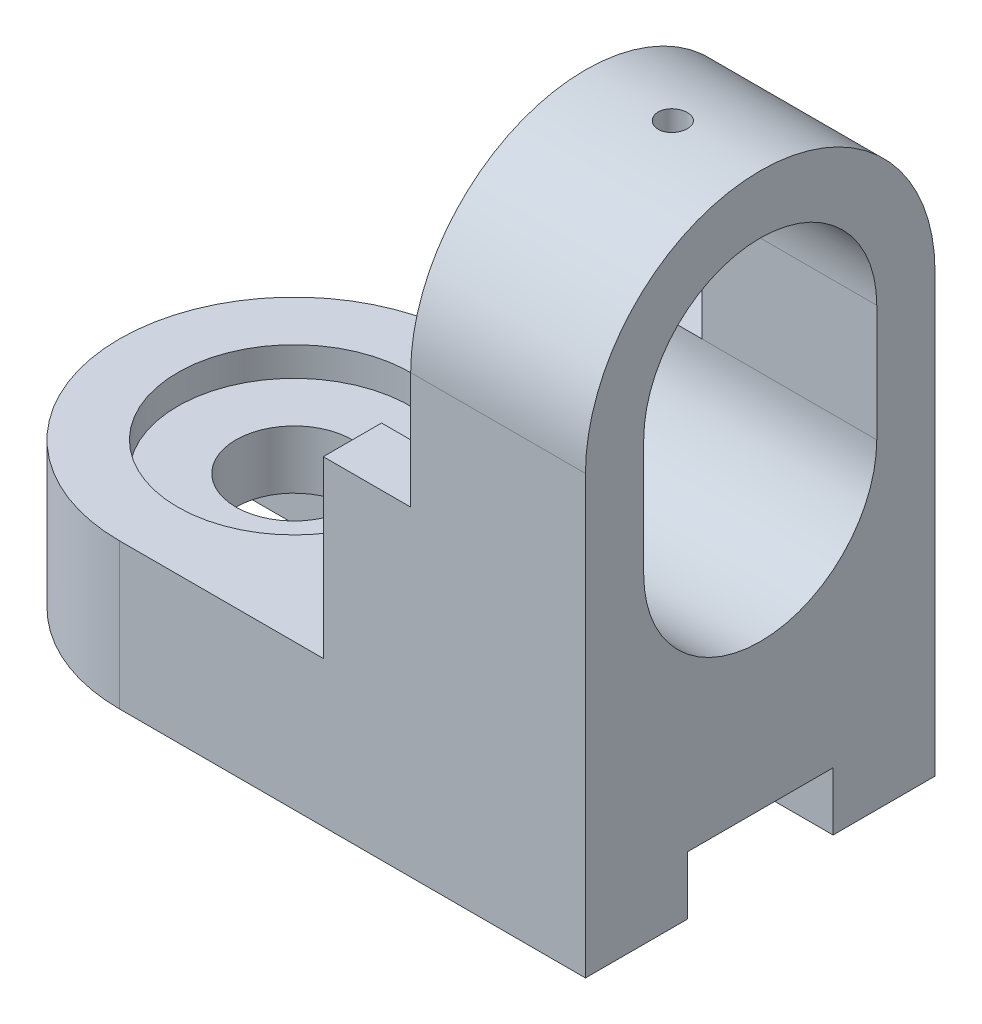
ISO-10303-21;
HEADER;
FILE_DESCRIPTION(('STEP AP214'),'2;1');
FILE_NAME('part.step','',(''),(''),'','','');
FILE_SCHEMA(('AUTOMOTIVE_DESIGN { 1 0 10303 214 1 1 1 1 }'));
ENDSEC;
DATA;
#1=APPLICATION_CONTEXT('core data for automotive mechanical design processes');
#2=APPLICATION_PROTOCOL_DEFINITION('international standard','automotive_design',2000,#1);
#3=PRODUCT_CONTEXT('',#1,'mechanical');
#4=PRODUCT('Part','Part','',(#3));
#5=PRODUCT_RELATED_PRODUCT_CATEGORY('part','',(#4));
#6=PRODUCT_DEFINITION_FORMATION('','',#4);
#7=PRODUCT_DEFINITION_CONTEXT('part definition',#1,'design');
#8=PRODUCT_DEFINITION('design','',#6,#7);
#9=PRODUCT_DEFINITION_SHAPE('','',#8);
#10=(LENGTH_UNIT() NAMED_UNIT(*) SI_UNIT(.MILLI.,.METRE.));
#11=(NAMED_UNIT(*) PLANE_ANGLE_UNIT() SI_UNIT($,.RADIAN.));
#12=(NAMED_UNIT(*) SI_UNIT($,.STERADIAN.) SOLID_ANGLE_UNIT());
#13=UNCERTAINTY_MEASURE_WITH_UNIT(LENGTH_MEASURE(1.E-05),#10,'distance_accuracy_value','');
#14=(GEOMETRIC_REPRESENTATION_CONTEXT(3) GLOBAL_UNCERTAINTY_ASSIGNED_CONTEXT((#13)) GLOBAL_UNIT_ASSIGNED_CONTEXT((#10,
#11,#12)) REPRESENTATION_CONTEXT('',''));
#15=CARTESIAN_POINT('',(0.,0.,0.));
#16=DIRECTION('',(0.,0.,1.));
#17=DIRECTION('',(1.,0.,0.));
#18=AXIS2_PLACEMENT_3D('',#15,#16,#17);
#19=CARTESIAN_POINT('',(35.,75.,0.));
#20=DIRECTION('',(1.,0.,0.));
#21=DIRECTION('',(0.,0.,-1.));
#22=AXIS2_PLACEMENT_3D('',#19,#20,#21);
#23=CYLINDRICAL_SURFACE('',#22,20.);
#24=DIRECTION('',(1.,0.,0.));
#25=VECTOR('',#24,1.);
#26=CARTESIAN_POINT('',(35.,75.,20.));
#27=LINE('',#26,#25);
#28=CARTESIAN_POINT('',(50.,75.,20.));
#29=VERTEX_POINT('',#28);
#30=CARTESIAN_POINT('',(80.,75.,20.));
#31=VERTEX_POINT('',#30);
#32=EDGE_CURVE('E246',#29,#31,#27,.T.);
#33=ORIENTED_EDGE('',*,*,#32,.F.);
#34=CARTESIAN_POINT('',(50.,75.,0.));
#35=DIRECTION('',(1.,0.,0.));
#36=DIRECTION('',(0.,0.,-1.));
#37=AXIS2_PLACEMENT_3D('',#34,#35,#36);
#38=CIRCLE('',#37,20.);
#39=CARTESIAN_POINT('',(50.,75.,-20.));
#40=VERTEX_POINT('',#39);
#41=EDGE_CURVE('E333',#29,#40,#38,.F.);
#42=ORIENTED_EDGE('',*,*,#41,.T.);
#43=DIRECTION('',(1.,0.,0.));
#44=VECTOR('',#43,1.);
#45=CARTESIAN_POINT('',(35.,75.,-20.));
#46=LINE('',#45,#44);
#47=CARTESIAN_POINT('',(80.,75.,-20.));
#48=VERTEX_POINT('',#47);
#49=EDGE_CURVE('E244',#40,#48,#46,.T.);
#50=ORIENTED_EDGE('',*,*,#49,.T.);
#51=CARTESIAN_POINT('',(80.,75.,0.));
#52=DIRECTION('',(1.,0.,0.));
#53=DIRECTION('',(0.,0.,-1.));
#54=AXIS2_PLACEMENT_3D('',#51,#52,#53);
#55=CIRCLE('',#54,20.);
#56=EDGE_CURVE('E235',#48,#31,#55,.T.);
#57=ORIENTED_EDGE('',*,*,#56,.T.);
#58=EDGE_LOOP('',(#33,#42,#50,#57));
#59=FACE_BOUND('',#58,.T.);
#60=CARTESIAN_POINT('',(65.,94.8431348329844,-2.5));
#61=CARTESIAN_POINT('',(65.1398362838005,94.8431368414673,-2.49999405483337));
#62=CARTESIAN_POINT('',(65.2797599649306,94.8446289499888,-2.48822789901659));
#63=CARTESIAN_POINT('',(65.5557132254284,94.8504339085542,-2.44147641371666));
#64=CARTESIAN_POINT('',(65.6917385805018,94.8547497060959,-2.4064668210908));
#65=CARTESIAN_POINT('',(65.9558598821076,94.8657057380876,-2.31427669282773));
#66=CARTESIAN_POINT('',(66.0839611421164,94.8723443946258,-2.25711120479872));
#67=CARTESIAN_POINT('',(66.3287284518253,94.8871962351098,-2.12226419842906));
#68=CARTESIAN_POINT('',(66.4453964517436,94.8954091498188,-2.04458618737467));
#69=CARTESIAN_POINT('',(66.6646622471215,94.9125355924631,-1.87045345026456));
#70=CARTESIAN_POINT('',(66.7671868023187,94.9214524170269,-1.77390681502434));
#71=CARTESIAN_POINT('',(66.9546227689392,94.9389523287518,-1.5649752606712));
#72=CARTESIAN_POINT('',(67.0395333040947,94.9475353992921,-1.45258955405803));
#73=CARTESIAN_POINT('',(67.1895935795063,94.96343444613,-1.21470983067598));
#74=CARTESIAN_POINT('',(67.2546770450996,94.9707461384685,-1.08917369556112));
#75=CARTESIAN_POINT('',(67.362811199941,94.9832423695448,-0.828846718055924));
#76=CARTESIAN_POINT('',(67.4058627069265,94.9884269872295,-0.694056219360914));
#77=CARTESIAN_POINT('',(67.4684920683344,94.9960616870624,-0.419795687751122));
#78=CARTESIAN_POINT('',(67.4881916785239,94.9985259483594,-0.280353859663387));
#79=CARTESIAN_POINT('',(67.5039353850365,95.0004906972921,-0.000123200686556063));
#80=CARTESIAN_POINT('',(67.4999804119525,94.9999913015208,0.140665576994761));
#81=CARTESIAN_POINT('',(67.4686247972426,94.9960964777001,0.418765268974537));
#82=CARTESIAN_POINT('',(67.4413551015186,94.9927172245573,0.556091205764442));
#83=CARTESIAN_POINT('',(67.3643488233701,94.9834605594233,0.824202163905364));
#84=CARTESIAN_POINT('',(67.3146118138332,94.9775830999404,0.954987060856193));
#85=CARTESIAN_POINT('',(67.1939435072162,94.9639625780791,1.20670881543863));
#86=CARTESIAN_POINT('',(67.1229555422698,94.9562145384324,1.32761822784051));
#87=CARTESIAN_POINT('',(66.961841637784,94.9397196906528,1.55585745230647));
#88=CARTESIAN_POINT('',(66.8717148205314,94.9309728367226,1.66318664121735));
#89=CARTESIAN_POINT('',(66.6741481814016,94.9133886752351,1.86198803077293));
#90=CARTESIAN_POINT('',(66.5665942404533,94.9045511580473,1.95334683999598));
#91=CARTESIAN_POINT('',(66.3376184432176,94.8878407194058,2.11673285062509));
#92=CARTESIAN_POINT('',(66.216196543462,94.8799678009758,2.18875999143508));
#93=CARTESIAN_POINT('',(65.9628305044377,94.8660780261272,2.31144457358272));
#94=CARTESIAN_POINT('',(65.8308819200468,94.8600619590813,2.36209292986232));
#95=CARTESIAN_POINT('',(65.5602605464732,94.8505824249595,2.44048165446808));
#96=CARTESIAN_POINT('',(65.4215880816913,94.847118834867,2.46822312679961));
#97=CARTESIAN_POINT('',(65.1424568180003,94.8431588878405,2.4998604319086));
#98=CARTESIAN_POINT('',(65.0020163769112,94.8426426744237,2.50391584199828));
#99=CARTESIAN_POINT('',(64.7224580703346,94.8445834111965,2.48848695323056));
#100=CARTESIAN_POINT('',(64.5833401767207,94.8470402980145,2.46900315610981));
#101=CARTESIAN_POINT('',(64.3108542364222,94.8546322848399,2.40718328579773));
#102=CARTESIAN_POINT('',(64.1774683848096,94.8597583269466,2.36492448374606));
#103=CARTESIAN_POINT('',(63.9196758451468,94.872103699708,2.25883371911613));
#104=CARTESIAN_POINT('',(63.7952694727591,94.8793231039076,2.19500099858122));
#105=CARTESIAN_POINT('',(63.558245356187,94.8950893135323,2.04718202215492));
#106=CARTESIAN_POINT('',(63.4456933346856,94.9036429273708,1.9630911195771));
#107=CARTESIAN_POINT('',(63.236243446065,94.9210923955102,1.77729074236895));
#108=CARTESIAN_POINT('',(63.139346188132,94.9299882631129,1.67558058242548));
#109=CARTESIAN_POINT('',(62.9633958126656,94.9471808868696,1.45673177555852));
#110=CARTESIAN_POINT('',(62.884447553205,94.9554739391252,1.33950849211704));
#111=CARTESIAN_POINT('',(62.7473617823662,94.9704711303161,1.09337258168179));
#112=CARTESIAN_POINT('',(62.689223851519,94.9771753012772,0.964460190368327));
#113=CARTESIAN_POINT('',(62.595582213092,94.9882229065318,0.698953859139462));
#114=CARTESIAN_POINT('',(62.5600179039684,94.992572656877,0.562381566511787));
#115=CARTESIAN_POINT('',(62.5123359107733,94.9984475467757,0.285146057277968));
#116=CARTESIAN_POINT('',(62.5002171694008,94.9999728137019,0.144483025438114));
#117=CARTESIAN_POINT('',(62.4997900777079,95.0000262801365,-0.135917183343772));
#118=CARTESIAN_POINT('',(62.511320039432,94.998574831678,-0.275654137714715));
#119=CARTESIAN_POINT('',(62.5575206134309,94.9928784115798,-0.55118774145261));
#120=CARTESIAN_POINT('',(62.5921912096118,94.9886334418829,-0.686984393559869));
#121=CARTESIAN_POINT('',(62.6836381143496,94.9778248521189,-0.950761442987277));
#122=CARTESIAN_POINT('',(62.740406679373,94.9712620443393,-1.07874456015945));
#123=CARTESIAN_POINT('',(62.8744213146078,94.9565444760682,-1.32339333714412));
#124=CARTESIAN_POINT('',(62.9516676282626,94.9483896966512,-1.44005886238843));
#125=CARTESIAN_POINT('',(63.1250432153355,94.9313319392356,-1.65958676796214));
#126=CARTESIAN_POINT('',(63.2212927935204,94.9224244127137,-1.76235378783276));
#127=CARTESIAN_POINT('',(63.4296929440321,94.9049015902109,-1.95034111882086));
#128=CARTESIAN_POINT('',(63.5418472775031,94.8962863639518,-2.03555726779919));
#129=CARTESIAN_POINT('',(63.779369922687,94.8802881136638,-2.18630524251151));
#130=CARTESIAN_POINT('',(63.9047875898932,94.8729099764648,-2.2517597831474));
#131=CARTESIAN_POINT('',(64.1648567405525,94.8602785801802,-2.36058528832413));
#132=CARTESIAN_POINT('',(64.2994979992923,94.8550230113382,-2.40398027122393));
#133=CARTESIAN_POINT('',(64.5290299870492,94.8485078683333,-2.4570658962405));
#134=CARTESIAN_POINT('',(64.6224729515397,94.8465030152111,-2.47314303101111));
#135=CARTESIAN_POINT('',(64.8105972499648,94.843815822307,-2.49461205590497));
#136=CARTESIAN_POINT('',(64.9052785744979,94.8431334724908,-2.5000040270997));
#137=CARTESIAN_POINT('',(65.,94.8431348329844,-2.5));
#138=B_SPLINE_CURVE_WITH_KNOTS('',3,(#60,#61,#62,#63,#64,#65,#66,#67,#68,#69,#70,#71,#72,#73,
#74,#75,#76,#77,#78,#79,#80,#81,#82,#83,#84,#85,#86,#87,#88,#89,#90,#91,#92,#93,#94,#95,#96,#97,
#98,#99,#100,#101,#102,#103,#104,#105,#106,#107,#108,#109,#110,#111,#112,#113,#114,#115,#116,
#117,#118,#119,#120,#121,#122,#123,#124,#125,#126,#127,#128,#129,#130,#131,#132,#133,#134,#135,
#136,#137),.UNSPECIFIED.,.T.,.F.,(4,2,2,2,2,2,2,2,2,2,2,2,2,2,2,2,2,2,2,2,2,2,2,2,2,2,2,2,2,2,2,
2,2,2,2,2,2,2,4),(0.,0.419162817491652,0.838763876176496,1.2580804526053,1.67732537953023,
2.09866577551476,2.5200271274499,2.94278186148152,3.36552090342241,3.78604596943868,
4.20655449172519,4.62471664935449,5.042886756742,5.46218204415215,5.88149656471515,
6.30367697380179,6.72585870621835,7.14821966741417,7.57056027158599,7.99005217808293,
8.40953514329525,8.82760376295143,9.24568707214264,9.66597819546522,10.0862856699722,
10.5089888589475,10.9316835271129,11.3532385678735,11.7747745977522,12.1934381629066,
12.612101436892,13.030618135465,13.4491398096666,13.8704012889325,14.2917625544224,
14.7147509770793,15.1372778598593,15.4212098963686,15.7051397785939),.UNSPECIFIED.);
#139=CARTESIAN_POINT('',(65.,94.8431348329844,-2.5));
#140=VERTEX_POINT('',#139);
#141=EDGE_CURVE('E309',#140,#140,#138,.T.);
#142=ORIENTED_EDGE('',*,*,#141,.F.);
#143=EDGE_LOOP('',(#142));
#144=FACE_BOUND('',#143,.T.);
#145=ADVANCED_FACE('F35',(#59,#144),#23,.F.);
#146=CARTESIAN_POINT('',(35.,75.,0.));
#147=DIRECTION('',(1.,0.,0.));
#148=DIRECTION('',(0.,0.,-1.));
#149=AXIS2_PLACEMENT_3D('',#146,#147,#148);
#150=CYLINDRICAL_SURFACE('',#149,30.);
#151=CARTESIAN_POINT('',(50.,75.,0.));
#152=DIRECTION('',(1.,0.,0.));
#153=DIRECTION('',(0.,0.,-1.));
#154=AXIS2_PLACEMENT_3D('',#151,#152,#153);
#155=CIRCLE('',#154,30.);
#156=CARTESIAN_POINT('',(50.,75.,30.));
#157=VERTEX_POINT('',#156);
#158=CARTESIAN_POINT('',(50.,75.,-30.));
#159=VERTEX_POINT('',#158);
#160=EDGE_CURVE('E338',#157,#159,#155,.F.);
#161=ORIENTED_EDGE('',*,*,#160,.F.);
#162=DIRECTION('',(1.,0.,0.));
#163=VECTOR('',#162,1.);
#164=CARTESIAN_POINT('',(35.,75.,30.));
#165=LINE('',#164,#163);
#166=CARTESIAN_POINT('',(80.,75.,30.));
#167=VERTEX_POINT('',#166);
#168=EDGE_CURVE('E224',#157,#167,#165,.T.);
#169=ORIENTED_EDGE('',*,*,#168,.T.);
#170=CARTESIAN_POINT('',(80.,75.,0.));
#171=DIRECTION('',(1.,0.,0.));
#172=DIRECTION('',(0.,0.,-1.));
#173=AXIS2_PLACEMENT_3D('',#170,#171,#172);
#174=CIRCLE('',#173,30.);
#175=CARTESIAN_POINT('',(80.,75.,-30.));
#176=VERTEX_POINT('',#175);
#177=EDGE_CURVE('E225',#176,#167,#174,.T.);
#178=ORIENTED_EDGE('',*,*,#177,.F.);
#179=DIRECTION('',(1.,0.,0.));
#180=VECTOR('',#179,1.);
#181=CARTESIAN_POINT('',(35.,75.,-30.));
#182=LINE('',#181,#180);
#183=EDGE_CURVE('E252',#159,#176,#182,.T.);
#184=ORIENTED_EDGE('',*,*,#183,.F.);
#185=EDGE_LOOP('',(#161,#169,#178,#184));
#186=FACE_BOUND('',#185,.T.);
#187=CARTESIAN_POINT('',(65.,104.895651857753,-2.5));
#188=CARTESIAN_POINT('',(65.140164271976,104.895653240209,-2.49999387707595));
#189=CARTESIAN_POINT('',(65.2804239653942,104.896648199565,-2.48817272989955));
#190=CARTESIAN_POINT('',(65.5570625508586,104.900520493732,-2.44118994768572));
#191=CARTESIAN_POINT('',(65.693436862819,104.903399961378,-2.40600186590413));
#192=CARTESIAN_POINT('',(65.9582579903133,104.9107128874,-2.31330996184381));
#193=CARTESIAN_POINT('',(66.0867092523874,104.91514546464,-2.25581879093882));
#194=CARTESIAN_POINT('',(66.3321079880248,104.92506406754,-2.12017517121364));
#195=CARTESIAN_POINT('',(66.4490579136376,104.930549867918,-2.04202713953173));
#196=CARTESIAN_POINT('',(66.6684650076666,104.941972619487,-1.86707134114509));
#197=CARTESIAN_POINT('',(66.7708885796574,104.947910569226,-1.7702215035047));
#198=CARTESIAN_POINT('',(66.958046915595,104.959559415269,-1.56070030169024));
#199=CARTESIAN_POINT('',(67.0427809067189,104.965270301646,-1.4480282466342));
#200=CARTESIAN_POINT('',(67.1922665366404,104.975831012688,-1.20986061327198));
#201=CARTESIAN_POINT('',(67.2569891079536,104.980679580499,-1.08434673031465));
#202=CARTESIAN_POINT('',(67.3644287277962,104.988958594307,-0.824186001246913));
#203=CARTESIAN_POINT('',(67.4071461614955,104.992389065127,-0.689539315040408));
#204=CARTESIAN_POINT('',(67.4692662096401,104.997438386317,-0.41526948986953));
#205=CARTESIAN_POINT('',(67.4887231777986,104.999061459499,-0.275658740580807));
#206=CARTESIAN_POINT('',(67.5039380079615,105.000327418356,0.0048557047245437));
#207=CARTESIAN_POINT('',(67.4996963106748,104.999970340854,0.145759376648867));
#208=CARTESIAN_POINT('',(67.4676786695516,104.99731971597,0.424491378797032));
#209=CARTESIAN_POINT('',(67.4399611754895,104.995030978063,0.56232647518116));
#210=CARTESIAN_POINT('',(67.3618696225948,104.988779996365,0.831381165100608));
#211=CARTESIAN_POINT('',(67.3114953481936,104.984817736652,0.962600695678749));
#212=CARTESIAN_POINT('',(67.1894550322036,104.975657197807,1.21488540159214));
#213=CARTESIAN_POINT('',(67.1177628135031,104.970457400634,1.33593785664744));
#214=CARTESIAN_POINT('',(66.9551406960534,104.959406131731,1.56431333969343));
#215=CARTESIAN_POINT('',(66.8642104070859,104.953554646784,1.67163608912467));
#216=CARTESIAN_POINT('',(66.6653639001119,104.941836618682,1.86984741195473));
#217=CARTESIAN_POINT('',(66.557396892953,104.935970083817,1.96068504166256));
#218=CARTESIAN_POINT('',(66.3277187372092,104.924901044309,2.12295399730675));
#219=CARTESIAN_POINT('',(66.2060075772946,104.919698540215,2.19438530724578));
#220=CARTESIAN_POINT('',(65.9522602805705,104.910545652425,2.31581201148312));
#221=CARTESIAN_POINT('',(65.8202228726328,104.906595423184,2.36580476183674));
#222=CARTESIAN_POINT('',(65.5495882048725,104.900397332,2.44289751757127));
#223=CARTESIAN_POINT('',(65.4109910830255,104.898149434267,2.469998004237));
#224=CARTESIAN_POINT('',(65.1316170336118,104.895616322413,2.50047245728154));
#225=CARTESIAN_POINT('',(64.9908479063828,104.895325231706,2.50391746529471));
#226=CARTESIAN_POINT('',(64.7107341408759,104.896723180345,2.48716926261205));
#227=CARTESIAN_POINT('',(64.5713894893237,104.898412201223,2.46697627239705));
#228=CARTESIAN_POINT('',(64.2982841105011,104.903574703619,2.4035845031062));
#229=CARTESIAN_POINT('',(64.1645156350923,104.907045613312,2.36041887747362));
#230=CARTESIAN_POINT('',(63.9061197945907,104.91537867449,2.2523408555746));
#231=CARTESIAN_POINT('',(63.7814925762118,104.920240848299,2.18742811036767));
#232=CARTESIAN_POINT('',(63.5445918694519,104.93082283658,2.03751871994737));
#233=CARTESIAN_POINT('',(63.432348429004,104.936544660835,1.9524747342126));
#234=CARTESIAN_POINT('',(63.2237051477329,104.948194444344,1.76478532103877));
#235=CARTESIAN_POINT('',(63.1273055795942,104.954122407144,1.66213959072317));
#236=CARTESIAN_POINT('',(62.9528439855749,104.965534027721,1.44185343227935));
#237=CARTESIAN_POINT('',(62.8748281174922,104.971016544952,1.32417638102457));
#238=CARTESIAN_POINT('',(62.7396652160886,104.980903096776,1.07735048303601));
#239=CARTESIAN_POINT('',(62.6825179742282,104.985307142147,0.948201750954439));
#240=CARTESIAN_POINT('',(62.5907937939598,104.992535280484,0.682263946917597));
#241=CARTESIAN_POINT('',(62.5561883121354,104.995361370879,0.545484776301517));
#242=CARTESIAN_POINT('',(62.5104366856148,104.999123283246,0.26803294766575));
#243=CARTESIAN_POINT('',(62.4992900968711,105.000059140997,0.127360363394576));
#244=CARTESIAN_POINT('',(62.5007778490024,104.999935196834,-0.153430120989747));
#245=CARTESIAN_POINT('',(62.5133402545964,104.998881431617,-0.293548410528456));
#246=CARTESIAN_POINT('',(62.5617393862788,104.994908584889,-0.569677780153325));
#247=CARTESIAN_POINT('',(62.5975761439793,104.991989500844,-0.705688854660694));
#248=CARTESIAN_POINT('',(62.6914884253059,104.984613542598,-0.969747616121871));
#249=CARTESIAN_POINT('',(62.7495626567074,104.980156757755,-1.09779576530064));
#250=CARTESIAN_POINT('',(62.8862931134942,104.97020399902,-1.34233643224755));
#251=CARTESIAN_POINT('',(62.964949013398,104.964708041561,-1.45882913271514));
#252=CARTESIAN_POINT('',(63.1408800371227,104.953273962541,-1.67732022356364));
#253=CARTESIAN_POINT('',(63.2382083883664,104.947334607337,-1.77927568996153));
#254=CARTESIAN_POINT('',(63.4486254218149,104.935693624505,-1.96544456639885));
#255=CARTESIAN_POINT('',(63.5617179152072,104.929992054799,-2.04965367362057));
#256=CARTESIAN_POINT('',(63.8006725017524,104.919460610217,-2.19805344744713));
#257=CARTESIAN_POINT('',(63.9265581250031,104.914632388705,-2.26220630864616));
#258=CARTESIAN_POINT('',(64.1872685918365,104.906414490131,-2.36838225233448));
#259=CARTESIAN_POINT('',(64.3220829560431,104.903023160058,-2.41043077732366));
#260=CARTESIAN_POINT('',(64.548077210568,104.898935204702,-2.46049524501521));
#261=CARTESIAN_POINT('',(64.6378036319464,104.897709609726,-2.47528983514609));
#262=CARTESIAN_POINT('',(64.8183400079371,104.896067489307,-2.49504418376664));
#263=CARTESIAN_POINT('',(64.909149959637,104.89565096169,-2.50000396868538));
#264=CARTESIAN_POINT('',(65.,104.895651857753,-2.5));
#265=B_SPLINE_CURVE_WITH_KNOTS('',3,(#187,#188,#189,#190,#191,#192,#193,#194,#195,#196,#197,
#198,#199,#200,#201,#202,#203,#204,#205,#206,#207,#208,#209,#210,#211,#212,#213,#214,#215,#216,
#217,#218,#219,#220,#221,#222,#223,#224,#225,#226,#227,#228,#229,#230,#231,#232,#233,#234,#235,
#236,#237,#238,#239,#240,#241,#242,#243,#244,#245,#246,#247,#248,#249,#250,#251,#252,#253,#254,
#255,#256,#257,#258,#259,#260,#261,#262,#263,#264),.UNSPECIFIED.,.T.,.F.,(4,2,2,2,2,2,2,2,2,2,2,
2,2,2,2,2,2,2,2,2,2,2,2,2,2,2,2,2,2,2,2,2,2,2,2,2,2,2,4),(0.,0.420161105126472,
0.840798561792926,1.26119776094297,1.68150713708955,2.10277327972936,2.5240578228075,
2.94595145651179,3.36783770529443,3.78873617555055,4.2096268186526,4.62947260311707,
5.04932238229937,5.46968985502512,5.89006585515617,6.31171960057012,6.73337369356764,
7.15507977278699,7.57677698587605,7.99720721074765,8.41763351413367,8.83745470924513,
9.2572826408636,9.67810782107509,10.0989402432321,10.5208182934246,10.9426921276865,
11.3640307220251,11.7853613408798,12.2054156584348,12.62547054652,13.0455010288207,
13.4655248690968,13.8867643080923,14.3081057644345,14.7302367134679,15.1518807121846,
15.42421656069,15.6965516773468),.UNSPECIFIED.);
#266=CARTESIAN_POINT('',(65.,104.895651857753,-2.5));
#267=VERTEX_POINT('',#266);
#268=EDGE_CURVE('E39',#267,#267,#265,.T.);
#269=ORIENTED_EDGE('',*,*,#268,.T.);
#270=EDGE_LOOP('',(#269));
#271=FACE_BOUND('',#270,.T.);
#272=ADVANCED_FACE('F426',(#186,#271),#150,.T.);
#273=CARTESIAN_POINT('',(0.,25.,0.));
#274=DIRECTION('',(0.,-1.,0.));
#275=DIRECTION('',(0.,0.,-1.));
#276=AXIS2_PLACEMENT_3D('',#273,#274,#275);
#277=CYLINDRICAL_SURFACE('',#276,10.);
#278=CARTESIAN_POINT('',(0.,10.,0.));
#279=DIRECTION('',(0.,1.,0.));
#280=DIRECTION('',(-1.,0.,0.));
#281=AXIS2_PLACEMENT_3D('',#278,#279,#280);
#282=CIRCLE('',#281,10.);
#283=CARTESIAN_POINT('',(-10.,10.,0.));
#284=VERTEX_POINT('',#283);
#285=EDGE_CURVE('E284',#284,#284,#282,.T.);
#286=ORIENTED_EDGE('',*,*,#285,.F.);
#287=EDGE_LOOP('',(#286));
#288=FACE_BOUND('',#287,.T.);
#289=CARTESIAN_POINT('',(0.,20.,0.));
#290=DIRECTION('',(0.,1.,0.));
#291=DIRECTION('',(0.,0.,1.));
#292=AXIS2_PLACEMENT_3D('',#289,#290,#291);
#293=CIRCLE('',#292,10.);
#294=CARTESIAN_POINT('',(0.,20.,10.));
#295=VERTEX_POINT('',#294);
#296=EDGE_CURVE('E194',#295,#295,#293,.T.);
#297=ORIENTED_EDGE('',*,*,#296,.T.);
#298=EDGE_LOOP('',(#297));
#299=FACE_BOUND('',#298,.T.);
#300=ADVANCED_FACE('F431',(#288,#299),#277,.F.);
#301=CARTESIAN_POINT('',(35.,55.,0.));
#302=DIRECTION('',(1.,0.,0.));
#303=DIRECTION('',(0.,0.,-1.));
#304=AXIS2_PLACEMENT_3D('',#301,#302,#303);
#305=CYLINDRICAL_SURFACE('',#304,20.);
#306=DIRECTION('',(1.,0.,0.));
#307=VECTOR('',#306,1.);
#308=CARTESIAN_POINT('',(35.,41.771243444677,15.));
#309=LINE('',#308,#307);
#310=CARTESIAN_POINT('',(35.,41.771243444677,15.));
#311=VERTEX_POINT('',#310);
#312=CARTESIAN_POINT('',(45.,41.771243444677,15.));
#313=VERTEX_POINT('',#312);
#314=EDGE_CURVE('E323',#311,#313,#309,.T.);
#315=ORIENTED_EDGE('',*,*,#314,.F.);
#316=CARTESIAN_POINT('',(35.,55.,0.));
#317=DIRECTION('',(1.,0.,0.));
#318=DIRECTION('',(0.,0.,-1.));
#319=AXIS2_PLACEMENT_3D('',#316,#317,#318);
#320=CIRCLE('',#319,20.);
#321=CARTESIAN_POINT('',(35.,55.,20.));
#322=VERTEX_POINT('',#321);
#323=EDGE_CURVE('E204',#322,#311,#320,.T.);
#324=ORIENTED_EDGE('',*,*,#323,.F.);
#325=DIRECTION('',(1.,0.,0.));
#326=VECTOR('',#325,1.);
#327=CARTESIAN_POINT('',(35.,55.,20.));
#328=LINE('',#327,#326);
#329=CARTESIAN_POINT('',(50.,55.,20.));
#330=VERTEX_POINT('',#329);
#331=EDGE_CURVE('E248',#322,#330,#328,.T.);
#332=ORIENTED_EDGE('',*,*,#331,.T.);
#333=CARTESIAN_POINT('',(80.,55.,20.));
#334=VERTEX_POINT('',#333);
#335=EDGE_CURVE('E251',#330,#334,#328,.T.);
#336=ORIENTED_EDGE('',*,*,#335,.T.);
#337=CARTESIAN_POINT('',(80.,55.,0.));
#338=DIRECTION('',(1.,0.,0.));
#339=DIRECTION('',(0.,0.,-1.));
#340=AXIS2_PLACEMENT_3D('',#337,#338,#339);
#341=CIRCLE('',#340,20.);
#342=CARTESIAN_POINT('',(80.,55.,-20.));
#343=VERTEX_POINT('',#342);
#344=EDGE_CURVE('E228',#334,#343,#341,.T.);
#345=ORIENTED_EDGE('',*,*,#344,.T.);
#346=DIRECTION('',(1.,0.,0.));
#347=VECTOR('',#346,1.);
#348=CARTESIAN_POINT('',(35.,55.,-20.));
#349=LINE('',#348,#347);
#350=CARTESIAN_POINT('',(50.,55.,-20.));
#351=VERTEX_POINT('',#350);
#352=EDGE_CURVE('E243',#351,#343,#349,.T.);
#353=ORIENTED_EDGE('',*,*,#352,.F.);
#354=CARTESIAN_POINT('',(35.,55.,-20.));
#355=VERTEX_POINT('',#354);
#356=EDGE_CURVE('E240',#355,#351,#349,.T.);
#357=ORIENTED_EDGE('',*,*,#356,.F.);
#358=CARTESIAN_POINT('',(35.,41.771243444677,-15.));
#359=VERTEX_POINT('',#358);
#360=EDGE_CURVE('E222',#359,#355,#320,.T.);
#361=ORIENTED_EDGE('',*,*,#360,.F.);
#362=DIRECTION('',(1.,0.,0.));
#363=VECTOR('',#362,1.);
#364=CARTESIAN_POINT('',(35.,41.771243444677,-15.));
#365=LINE('',#364,#363);
#366=CARTESIAN_POINT('',(45.,41.771243444677,-15.));
#367=VERTEX_POINT('',#366);
#368=EDGE_CURVE('E321',#367,#359,#365,.F.);
#369=ORIENTED_EDGE('',*,*,#368,.F.);
#370=CARTESIAN_POINT('',(45.,55.,0.));
#371=DIRECTION('',(-1.,0.,0.));
#372=DIRECTION('',(0.,0.,1.));
#373=AXIS2_PLACEMENT_3D('',#370,#371,#372);
#374=CIRCLE('',#373,20.);
#375=EDGE_CURVE('E11',#313,#367,#374,.F.);
#376=ORIENTED_EDGE('',*,*,#375,.F.);
#377=EDGE_LOOP('',(#315,#324,#332,#336,#345,#353,#357,#361,#369,#376));
#378=FACE_BOUND('',#377,.T.);
#379=ADVANCED_FACE('F389',(#378),#305,.F.);
#380=CARTESIAN_POINT('',(35.,0.,0.));
#381=DIRECTION('',(1.,0.,0.));
#382=DIRECTION('',(0.,0.,-1.));
#383=AXIS2_PLACEMENT_3D('',#380,#381,#382);
#384=PLANE('',#383);
#385=DIRECTION('',(0.,1.,0.));
#386=VECTOR('',#385,1.);
#387=CARTESIAN_POINT('',(35.,0.,15.));
#388=LINE('',#387,#386);
#389=CARTESIAN_POINT('',(35.,25.,15.));
#390=VERTEX_POINT('',#389);
#391=EDGE_CURVE('E48',#390,#311,#388,.T.);
#392=ORIENTED_EDGE('',*,*,#391,.F.);
#393=DIRECTION('',(0.,0.,1.));
#394=VECTOR('',#393,1.);
#395=CARTESIAN_POINT('',(35.,25.,0.));
#396=LINE('',#395,#394);
#397=CARTESIAN_POINT('',(35.,25.,30.));
#398=VERTEX_POINT('',#397);
#399=EDGE_CURVE('E200',#390,#398,#396,.T.);
#400=ORIENTED_EDGE('',*,*,#399,.T.);
#401=DIRECTION('',(0.,1.,0.));
#402=VECTOR('',#401,1.);
#403=CARTESIAN_POINT('',(35.,0.,30.));
#404=LINE('',#403,#402);
#405=CARTESIAN_POINT('',(35.,55.,30.));
#406=VERTEX_POINT('',#405);
#407=EDGE_CURVE('E212',#398,#406,#404,.T.);
#408=ORIENTED_EDGE('',*,*,#407,.T.);
#409=DIRECTION('',(0.,0.,-1.));
#410=VECTOR('',#409,1.);
#411=CARTESIAN_POINT('',(35.,55.,0.));
#412=LINE('',#411,#410);
#413=EDGE_CURVE('E295',#406,#322,#412,.T.);
#414=ORIENTED_EDGE('',*,*,#413,.T.);
#415=ORIENTED_EDGE('',*,*,#323,.T.);
#416=EDGE_LOOP('',(#392,#400,#408,#414,#415));
#417=FACE_BOUND('',#416,.T.);
#418=ADVANCED_FACE('F198',(#417),#384,.F.);
#419=DIRECTION('',(0.,-1.,0.));
#420=VECTOR('',#419,1.);
#421=CARTESIAN_POINT('',(35.,0.,-15.));
#422=LINE('',#421,#420);
#423=CARTESIAN_POINT('',(35.,25.,-15.));
#424=VERTEX_POINT('',#423);
#425=EDGE_CURVE('E205',#359,#424,#422,.T.);
#426=ORIENTED_EDGE('',*,*,#425,.F.);
#427=ORIENTED_EDGE('',*,*,#360,.T.);
#428=CARTESIAN_POINT('',(35.,55.,-30.));
#429=VERTEX_POINT('',#428);
#430=EDGE_CURVE('E293',#355,#429,#412,.T.);
#431=ORIENTED_EDGE('',*,*,#430,.T.);
#432=DIRECTION('',(0.,1.,0.));
#433=VECTOR('',#432,1.);
#434=CARTESIAN_POINT('',(35.,0.,-30.));
#435=LINE('',#434,#433);
#436=CARTESIAN_POINT('',(35.,25.,-30.));
#437=VERTEX_POINT('',#436);
#438=EDGE_CURVE('E215',#437,#429,#435,.T.);
#439=ORIENTED_EDGE('',*,*,#438,.F.);
#440=EDGE_CURVE('E211',#437,#424,#396,.T.);
#441=ORIENTED_EDGE('',*,*,#440,.T.);
#442=EDGE_LOOP('',(#426,#427,#431,#439,#441));
#443=FACE_BOUND('',#442,.T.);
#444=ADVANCED_FACE('F401',(#443),#384,.F.);
#445=CARTESIAN_POINT('',(0.,0.,0.));
#446=DIRECTION('',(0.,1.,0.));
#447=DIRECTION('',(0.,0.,1.));
#448=AXIS2_PLACEMENT_3D('',#445,#446,#447);
#449=PLANE('',#448);
#450=DIRECTION('',(1.,0.,0.));
#451=VECTOR('',#450,1.);
#452=CARTESIAN_POINT('',(-30.,0.,12.5));
#453=LINE('',#452,#451);
#454=CARTESIAN_POINT('',(-27.2717802865893,0.,12.5));
#455=VERTEX_POINT('',#454);
#456=CARTESIAN_POINT('',(80.,0.,12.5));
#457=VERTEX_POINT('',#456);
#458=EDGE_CURVE('E346',#455,#457,#453,.T.);
#459=ORIENTED_EDGE('',*,*,#458,.T.);
#460=DIRECTION('',(0.,0.,-1.));
#461=VECTOR('',#460,1.);
#462=CARTESIAN_POINT('',(80.,0.,30.));
#463=LINE('',#462,#461);
#464=CARTESIAN_POINT('',(80.,0.,30.));
#465=VERTEX_POINT('',#464);
#466=EDGE_CURVE('E262',#465,#457,#463,.T.);
#467=ORIENTED_EDGE('',*,*,#466,.F.);
#468=DIRECTION('',(1.,0.,0.));
#469=VECTOR('',#468,1.);
#470=CARTESIAN_POINT('',(0.,0.,30.));
#471=LINE('',#470,#469);
#472=CARTESIAN_POINT('',(0.,0.,30.));
#473=VERTEX_POINT('',#472);
#474=EDGE_CURVE('E258',#473,#465,#471,.T.);
#475=ORIENTED_EDGE('',*,*,#474,.F.);
#476=CARTESIAN_POINT('',(0.,0.,0.));
#477=DIRECTION('',(0.,1.,0.));
#478=DIRECTION('',(0.,0.,1.));
#479=AXIS2_PLACEMENT_3D('',#476,#477,#478);
#480=CIRCLE('',#479,30.);
#481=EDGE_CURVE('E267',#455,#473,#480,.T.);
#482=ORIENTED_EDGE('',*,*,#481,.F.);
#483=EDGE_LOOP('',(#459,#467,#475,#482));
#484=FACE_BOUND('',#483,.T.);
#485=ADVANCED_FACE('F379',(#484),#449,.F.);
#486=CARTESIAN_POINT('',(0.,25.,0.));
#487=DIRECTION('',(0.,-1.,0.));
#488=DIRECTION('',(0.,0.,-1.));
#489=AXIS2_PLACEMENT_3D('',#486,#487,#488);
#490=CYLINDRICAL_SURFACE('',#489,30.);
#491=DIRECTION('',(0.,-1.,0.));
#492=VECTOR('',#491,1.);
#493=CARTESIAN_POINT('',(-27.2717802865893,25.,-12.5));
#494=LINE('',#493,#492);
#495=CARTESIAN_POINT('',(-27.2717802865893,0.,-12.5));
#496=VERTEX_POINT('',#495);
#497=CARTESIAN_POINT('',(-27.2717802865893,10.,-12.5));
#498=VERTEX_POINT('',#497);
#499=EDGE_CURVE('E290',#496,#498,#494,.F.);
#500=ORIENTED_EDGE('',*,*,#499,.T.);
#501=CARTESIAN_POINT('',(0.,10.,0.));
#502=DIRECTION('',(0.,1.,0.));
#503=DIRECTION('',(-1.,0.,0.));
#504=AXIS2_PLACEMENT_3D('',#501,#502,#503);
#505=CIRCLE('',#504,30.);
#506=CARTESIAN_POINT('',(-27.2717802865893,10.,12.5));
#507=VERTEX_POINT('',#506);
#508=EDGE_CURVE('E229',#498,#507,#505,.T.);
#509=ORIENTED_EDGE('',*,*,#508,.T.);
#510=DIRECTION('',(0.,-1.,0.));
#511=VECTOR('',#510,1.);
#512=CARTESIAN_POINT('',(-27.2717802865893,25.,12.5));
#513=LINE('',#512,#511);
#514=EDGE_CURVE('E283',#455,#507,#513,.F.);
#515=ORIENTED_EDGE('',*,*,#514,.F.);
#516=ORIENTED_EDGE('',*,*,#481,.T.);
#517=DIRECTION('',(0.,-1.,0.));
#518=VECTOR('',#517,1.);
#519=CARTESIAN_POINT('',(0.,25.,30.));
#520=LINE('',#519,#518);
#521=CARTESIAN_POINT('',(0.,25.,30.));
#522=VERTEX_POINT('',#521);
#523=EDGE_CURVE('E274',#522,#473,#520,.T.);
#524=ORIENTED_EDGE('',*,*,#523,.F.);
#525=CARTESIAN_POINT('',(0.,25.,0.));
#526=DIRECTION('',(0.,1.,0.));
#527=DIRECTION('',(0.,0.,1.));
#528=AXIS2_PLACEMENT_3D('',#525,#526,#527);
#529=CIRCLE('',#528,30.);
#530=CARTESIAN_POINT('',(0.,25.,-30.));
#531=VERTEX_POINT('',#530);
#532=EDGE_CURVE('E257',#531,#522,#529,.T.);
#533=ORIENTED_EDGE('',*,*,#532,.F.);
#534=DIRECTION('',(0.,-1.,0.));
#535=VECTOR('',#534,1.);
#536=CARTESIAN_POINT('',(0.,25.,-30.));
#537=LINE('',#536,#535);
#538=CARTESIAN_POINT('',(0.,0.,-30.));
#539=VERTEX_POINT('',#538);
#540=EDGE_CURVE('E277',#531,#539,#537,.T.);
#541=ORIENTED_EDGE('',*,*,#540,.T.);
#542=EDGE_CURVE('E268',#539,#496,#480,.T.);
#543=ORIENTED_EDGE('',*,*,#542,.T.);
#544=EDGE_LOOP('',(#500,#509,#515,#516,#524,#533,#541,#543));
#545=FACE_BOUND('',#544,.T.);
#546=ADVANCED_FACE('F364',(#545),#490,.T.);
#547=CARTESIAN_POINT('',(0.,25.,0.));
#548=DIRECTION('',(0.,1.,0.));
#549=DIRECTION('',(0.,0.,1.));
#550=AXIS2_PLACEMENT_3D('',#547,#548,#549);
#551=PLANE('',#550);
#552=CARTESIAN_POINT('',(0.,25.,0.));
#553=DIRECTION('',(0.,1.,0.));
#554=DIRECTION('',(0.,0.,1.));
#555=AXIS2_PLACEMENT_3D('',#552,#553,#554);
#556=CIRCLE('',#555,20.);
#557=CARTESIAN_POINT('',(0.,25.,20.));
#558=VERTEX_POINT('',#557);
#559=EDGE_CURVE('E304',#558,#558,#556,.T.);
#560=ORIENTED_EDGE('',*,*,#559,.F.);
#561=EDGE_LOOP('',(#560));
#562=FACE_BOUND('',#561,.T.);
#563=ORIENTED_EDGE('',*,*,#440,.F.);
#564=DIRECTION('',(-1.,0.,0.));
#565=VECTOR('',#564,1.);
#566=CARTESIAN_POINT('',(0.,25.,-30.));
#567=LINE('',#566,#565);
#568=EDGE_CURVE('E255',#437,#531,#567,.T.);
#569=ORIENTED_EDGE('',*,*,#568,.T.);
#570=ORIENTED_EDGE('',*,*,#532,.T.);
#571=DIRECTION('',(1.,0.,0.));
#572=VECTOR('',#571,1.);
#573=CARTESIAN_POINT('',(0.,25.,30.));
#574=LINE('',#573,#572);
#575=EDGE_CURVE('E209',#522,#398,#574,.T.);
#576=ORIENTED_EDGE('',*,*,#575,.T.);
#577=ORIENTED_EDGE('',*,*,#399,.F.);
#578=DIRECTION('',(1.,0.,0.));
#579=VECTOR('',#578,1.);
#580=CARTESIAN_POINT('',(35.,25.,15.));
#581=LINE('',#580,#579);
#582=CARTESIAN_POINT('',(45.,25.,15.));
#583=VERTEX_POINT('',#582);
#584=EDGE_CURVE('E185',#390,#583,#581,.T.);
#585=ORIENTED_EDGE('',*,*,#584,.T.);
#586=DIRECTION('',(0.,0.,-1.));
#587=VECTOR('',#586,1.);
#588=CARTESIAN_POINT('',(45.,25.,-15.));
#589=LINE('',#588,#587);
#590=CARTESIAN_POINT('',(45.,25.,-15.));
#591=VERTEX_POINT('',#590);
#592=EDGE_CURVE('E193',#583,#591,#589,.T.);
#593=ORIENTED_EDGE('',*,*,#592,.T.);
#594=DIRECTION('',(-1.,0.,0.));
#595=VECTOR('',#594,1.);
#596=CARTESIAN_POINT('',(35.,25.,-15.));
#597=LINE('',#596,#595);
#598=EDGE_CURVE('E56',#591,#424,#597,.T.);
#599=ORIENTED_EDGE('',*,*,#598,.T.);
#600=EDGE_LOOP('',(#563,#569,#570,#576,#577,#585,#593,#599));
#601=FACE_BOUND('',#600,.T.);
#602=ADVANCED_FACE('F207',(#562,#601),#551,.T.);
#603=CARTESIAN_POINT('',(80.,0.,-12.5));
#604=VERTEX_POINT('',#603);
#605=CARTESIAN_POINT('',(80.,0.,-30.));
#606=VERTEX_POINT('',#605);
#607=EDGE_CURVE('E242',#604,#606,#463,.T.);
#608=ORIENTED_EDGE('',*,*,#607,.F.);
#609=DIRECTION('',(1.,0.,0.));
#610=VECTOR('',#609,1.);
#611=CARTESIAN_POINT('',(-30.,0.,-12.5));
#612=LINE('',#611,#610);
#613=EDGE_CURVE('E347',#496,#604,#612,.T.);
#614=ORIENTED_EDGE('',*,*,#613,.F.);
#615=ORIENTED_EDGE('',*,*,#542,.F.);
#616=DIRECTION('',(-1.,0.,0.));
#617=VECTOR('',#616,1.);
#618=CARTESIAN_POINT('',(0.,0.,-30.));
#619=LINE('',#618,#617);
#620=EDGE_CURVE('E265',#606,#539,#619,.T.);
#621=ORIENTED_EDGE('',*,*,#620,.F.);
#622=EDGE_LOOP('',(#608,#614,#615,#621));
#623=FACE_BOUND('',#622,.T.);
#624=ADVANCED_FACE('F410',(#623),#449,.F.);
#625=CARTESIAN_POINT('',(80.,25.,30.));
#626=DIRECTION('',(-1.,0.,0.));
#627=DIRECTION('',(0.,0.,1.));
#628=AXIS2_PLACEMENT_3D('',#625,#626,#627);
#629=PLANE('',#628);
#630=DIRECTION('',(0.,0.,1.));
#631=VECTOR('',#630,1.);
#632=CARTESIAN_POINT('',(80.,9.99999999999999,-12.5));
#633=LINE('',#632,#631);
#634=CARTESIAN_POINT('',(80.,9.99999999999999,-12.5));
#635=VERTEX_POINT('',#634);
#636=CARTESIAN_POINT('',(80.,9.99999999999999,12.5));
#637=VERTEX_POINT('',#636);
#638=EDGE_CURVE('E287',#635,#637,#633,.T.);
#639=ORIENTED_EDGE('',*,*,#638,.F.);
#640=DIRECTION('',(0.,1.,0.));
#641=VECTOR('',#640,1.);
#642=CARTESIAN_POINT('',(80.,0.,-12.5));
#643=LINE('',#642,#641);
#644=EDGE_CURVE('E349',#604,#635,#643,.T.);
#645=ORIENTED_EDGE('',*,*,#644,.F.);
#646=ORIENTED_EDGE('',*,*,#607,.T.);
#647=DIRECTION('',(0.,-1.,0.));
#648=VECTOR('',#647,1.);
#649=CARTESIAN_POINT('',(80.,25.,-30.));
#650=LINE('',#649,#648);
#651=EDGE_CURVE('E280',#176,#606,#650,.T.);
#652=ORIENTED_EDGE('',*,*,#651,.F.);
#653=ORIENTED_EDGE('',*,*,#177,.T.);
#654=DIRECTION('',(0.,-1.,0.));
#655=VECTOR('',#654,1.);
#656=CARTESIAN_POINT('',(80.,25.,30.));
#657=LINE('',#656,#655);
#658=EDGE_CURVE('E261',#167,#465,#657,.T.);
#659=ORIENTED_EDGE('',*,*,#658,.T.);
#660=ORIENTED_EDGE('',*,*,#466,.T.);
#661=DIRECTION('',(0.,1.,0.));
#662=VECTOR('',#661,1.);
#663=CARTESIAN_POINT('',(80.,0.,12.5));
#664=LINE('',#663,#662);
#665=EDGE_CURVE('E357',#457,#637,#664,.T.);
#666=ORIENTED_EDGE('',*,*,#665,.T.);
#667=EDGE_LOOP('',(#639,#645,#646,#652,#653,#659,#660,#666));
#668=FACE_BOUND('',#667,.T.);
#669=ORIENTED_EDGE('',*,*,#344,.F.);
#670=DIRECTION('',(0.,-1.,0.));
#671=VECTOR('',#670,1.);
#672=CARTESIAN_POINT('',(80.,0.,20.));
#673=LINE('',#672,#671);
#674=EDGE_CURVE('E232',#31,#334,#673,.T.);
#675=ORIENTED_EDGE('',*,*,#674,.F.);
#676=ORIENTED_EDGE('',*,*,#56,.F.);
#677=DIRECTION('',(0.,-1.,0.));
#678=VECTOR('',#677,1.);
#679=CARTESIAN_POINT('',(80.,0.,-20.));
#680=LINE('',#679,#678);
#681=EDGE_CURVE('E216',#48,#343,#680,.T.);
#682=ORIENTED_EDGE('',*,*,#681,.T.);
#683=EDGE_LOOP('',(#669,#675,#676,#682));
#684=FACE_BOUND('',#683,.T.);
#685=ADVANCED_FACE('F37',(#668,#684),#629,.F.);
#686=CARTESIAN_POINT('',(0.,25.,-30.));
#687=DIRECTION('',(0.,0.,1.));
#688=DIRECTION('',(1.,0.,0.));
#689=AXIS2_PLACEMENT_3D('',#686,#687,#688);
#690=PLANE('',#689);
#691=DIRECTION('',(1.,0.,0.));
#692=VECTOR('',#691,1.);
#693=CARTESIAN_POINT('',(0.,55.,-30.));
#694=LINE('',#693,#692);
#695=CARTESIAN_POINT('',(50.,55.,-30.));
#696=VERTEX_POINT('',#695);
#697=EDGE_CURVE('E64',#429,#696,#694,.T.);
#698=ORIENTED_EDGE('',*,*,#697,.T.);
#699=DIRECTION('',(0.,1.,0.));
#700=VECTOR('',#699,1.);
#701=CARTESIAN_POINT('',(50.,25.,-30.));
#702=LINE('',#701,#700);
#703=EDGE_CURVE('E343',#696,#159,#702,.T.);
#704=ORIENTED_EDGE('',*,*,#703,.T.);
#705=ORIENTED_EDGE('',*,*,#183,.T.);
#706=ORIENTED_EDGE('',*,*,#651,.T.);
#707=ORIENTED_EDGE('',*,*,#620,.T.);
#708=ORIENTED_EDGE('',*,*,#540,.F.);
#709=ORIENTED_EDGE('',*,*,#568,.F.);
#710=ORIENTED_EDGE('',*,*,#438,.T.);
#711=EDGE_LOOP('',(#698,#704,#705,#706,#707,#708,#709,#710));
#712=FACE_BOUND('',#711,.T.);
#713=ADVANCED_FACE('F405',(#712),#690,.F.);
#714=CARTESIAN_POINT('',(0.,25.,30.));
#715=DIRECTION('',(0.,0.,-1.));
#716=DIRECTION('',(-1.,0.,0.));
#717=AXIS2_PLACEMENT_3D('',#714,#715,#716);
#718=PLANE('',#717);
#719=ORIENTED_EDGE('',*,*,#168,.F.);
#720=DIRECTION('',(0.,-1.,0.));
#721=VECTOR('',#720,1.);
#722=CARTESIAN_POINT('',(50.,25.,30.));
#723=LINE('',#722,#721);
#724=CARTESIAN_POINT('',(50.,55.,30.));
#725=VERTEX_POINT('',#724);
#726=EDGE_CURVE('E340',#157,#725,#723,.T.);
#727=ORIENTED_EDGE('',*,*,#726,.T.);
#728=DIRECTION('',(-1.,0.,0.));
#729=VECTOR('',#728,1.);
#730=CARTESIAN_POINT('',(0.,55.,30.));
#731=LINE('',#730,#729);
#732=EDGE_CURVE('E329',#725,#406,#731,.T.);
#733=ORIENTED_EDGE('',*,*,#732,.T.);
#734=ORIENTED_EDGE('',*,*,#407,.F.);
#735=ORIENTED_EDGE('',*,*,#575,.F.);
#736=ORIENTED_EDGE('',*,*,#523,.T.);
#737=ORIENTED_EDGE('',*,*,#474,.T.);
#738=ORIENTED_EDGE('',*,*,#658,.F.);
#739=EDGE_LOOP('',(#719,#727,#733,#734,#735,#736,#737,#738));
#740=FACE_BOUND('',#739,.T.);
#741=ADVANCED_FACE('F385',(#740),#718,.F.);
#742=CARTESIAN_POINT('',(35.,0.,-20.));
#743=DIRECTION('',(0.,0.,1.));
#744=DIRECTION('',(1.,0.,0.));
#745=AXIS2_PLACEMENT_3D('',#742,#743,#744);
#746=PLANE('',#745);
#747=DIRECTION('',(0.,1.,0.));
#748=VECTOR('',#747,1.);
#749=CARTESIAN_POINT('',(50.,0.,-20.));
#750=LINE('',#749,#748);
#751=EDGE_CURVE('E336',#351,#40,#750,.T.);
#752=ORIENTED_EDGE('',*,*,#751,.F.);
#753=ORIENTED_EDGE('',*,*,#352,.T.);
#754=ORIENTED_EDGE('',*,*,#681,.F.);
#755=ORIENTED_EDGE('',*,*,#49,.F.);
#756=EDGE_LOOP('',(#752,#753,#754,#755));
#757=FACE_BOUND('',#756,.T.);
#758=ADVANCED_FACE('F421',(#757),#746,.T.);
#759=CARTESIAN_POINT('',(35.,0.,20.));
#760=DIRECTION('',(0.,0.,1.));
#761=DIRECTION('',(1.,0.,0.));
#762=AXIS2_PLACEMENT_3D('',#759,#760,#761);
#763=PLANE('',#762);
#764=ORIENTED_EDGE('',*,*,#335,.F.);
#765=DIRECTION('',(0.,1.,0.));
#766=VECTOR('',#765,1.);
#767=CARTESIAN_POINT('',(50.,0.,20.));
#768=LINE('',#767,#766);
#769=EDGE_CURVE('E296',#330,#29,#768,.T.);
#770=ORIENTED_EDGE('',*,*,#769,.T.);
#771=ORIENTED_EDGE('',*,*,#32,.T.);
#772=ORIENTED_EDGE('',*,*,#674,.T.);
#773=EDGE_LOOP('',(#764,#770,#771,#772));
#774=FACE_BOUND('',#773,.T.);
#775=ADVANCED_FACE('F414',(#774),#763,.F.);
#776=CARTESIAN_POINT('',(0.,0.,-12.5));
#777=DIRECTION('',(0.,0.,-1.));
#778=DIRECTION('',(-1.,0.,0.));
#779=AXIS2_PLACEMENT_3D('',#776,#777,#778);
#780=PLANE('',#779);
#781=ORIENTED_EDGE('',*,*,#613,.T.);
#782=ORIENTED_EDGE('',*,*,#644,.T.);
#783=DIRECTION('',(-1.,0.,0.));
#784=VECTOR('',#783,1.);
#785=CARTESIAN_POINT('',(-30.,10.,-12.5));
#786=LINE('',#785,#784);
#787=EDGE_CURVE('E352',#635,#498,#786,.T.);
#788=ORIENTED_EDGE('',*,*,#787,.T.);
#789=ORIENTED_EDGE('',*,*,#499,.F.);
#790=EDGE_LOOP('',(#781,#782,#788,#789));
#791=FACE_BOUND('',#790,.T.);
#792=ADVANCED_FACE('F412',(#791),#780,.F.);
#793=CARTESIAN_POINT('',(0.,0.,12.5));
#794=DIRECTION('',(0.,0.,-1.));
#795=DIRECTION('',(-1.,0.,0.));
#796=AXIS2_PLACEMENT_3D('',#793,#794,#795);
#797=PLANE('',#796);
#798=ORIENTED_EDGE('',*,*,#514,.T.);
#799=DIRECTION('',(-1.,0.,0.));
#800=VECTOR('',#799,1.);
#801=CARTESIAN_POINT('',(-30.,10.,12.5));
#802=LINE('',#801,#800);
#803=EDGE_CURVE('E350',#637,#507,#802,.T.);
#804=ORIENTED_EDGE('',*,*,#803,.F.);
#805=ORIENTED_EDGE('',*,*,#665,.F.);
#806=ORIENTED_EDGE('',*,*,#458,.F.);
#807=EDGE_LOOP('',(#798,#804,#805,#806));
#808=FACE_BOUND('',#807,.T.);
#809=ADVANCED_FACE('F370',(#808),#797,.T.);
#810=CARTESIAN_POINT('',(-30.,10.,-12.5));
#811=DIRECTION('',(0.,1.,0.));
#812=DIRECTION('',(-1.,0.,0.));
#813=AXIS2_PLACEMENT_3D('',#810,#811,#812);
#814=PLANE('',#813);
#815=ORIENTED_EDGE('',*,*,#285,.T.);
#816=EDGE_LOOP('',(#815));
#817=FACE_BOUND('',#816,.T.);
#818=ORIENTED_EDGE('',*,*,#508,.F.);
#819=ORIENTED_EDGE('',*,*,#787,.F.);
#820=ORIENTED_EDGE('',*,*,#638,.T.);
#821=ORIENTED_EDGE('',*,*,#803,.T.);
#822=EDGE_LOOP('',(#818,#819,#820,#821));
#823=FACE_BOUND('',#822,.T.);
#824=ADVANCED_FACE('F371',(#817,#823),#814,.F.);
#825=CARTESIAN_POINT('',(50.,105.,-32.5));
#826=DIRECTION('',(1.,0.,0.));
#827=DIRECTION('',(0.,0.,-1.));
#828=AXIS2_PLACEMENT_3D('',#825,#826,#827);
#829=PLANE('',#828);
#830=DIRECTION('',(0.,0.,1.));
#831=VECTOR('',#830,1.);
#832=CARTESIAN_POINT('',(50.,55.,-32.5));
#833=LINE('',#832,#831);
#834=EDGE_CURVE('E328',#696,#351,#833,.T.);
#835=ORIENTED_EDGE('',*,*,#834,.T.);
#836=ORIENTED_EDGE('',*,*,#751,.T.);
#837=ORIENTED_EDGE('',*,*,#41,.F.);
#838=ORIENTED_EDGE('',*,*,#769,.F.);
#839=EDGE_CURVE('E325',#330,#725,#833,.T.);
#840=ORIENTED_EDGE('',*,*,#839,.T.);
#841=ORIENTED_EDGE('',*,*,#726,.F.);
#842=ORIENTED_EDGE('',*,*,#160,.T.);
#843=ORIENTED_EDGE('',*,*,#703,.F.);
#844=EDGE_LOOP('',(#835,#836,#837,#838,#840,#841,#842,#843));
#845=FACE_BOUND('',#844,.T.);
#846=ADVANCED_FACE('F559',(#845),#829,.F.);
#847=CARTESIAN_POINT('',(35.,55.,-32.5));
#848=DIRECTION('',(0.,-1.,0.));
#849=DIRECTION('',(0.,0.,-1.));
#850=AXIS2_PLACEMENT_3D('',#847,#848,#849);
#851=PLANE('',#850);
#852=ORIENTED_EDGE('',*,*,#430,.F.);
#853=ORIENTED_EDGE('',*,*,#356,.T.);
#854=ORIENTED_EDGE('',*,*,#834,.F.);
#855=ORIENTED_EDGE('',*,*,#697,.F.);
#856=EDGE_LOOP('',(#852,#853,#854,#855));
#857=FACE_BOUND('',#856,.T.);
#858=ADVANCED_FACE('F553',(#857),#851,.F.);
#859=ORIENTED_EDGE('',*,*,#839,.F.);
#860=ORIENTED_EDGE('',*,*,#331,.F.);
#861=ORIENTED_EDGE('',*,*,#413,.F.);
#862=ORIENTED_EDGE('',*,*,#732,.F.);
#863=EDGE_LOOP('',(#859,#860,#861,#862));
#864=FACE_BOUND('',#863,.T.);
#865=ADVANCED_FACE('F547',(#864),#851,.F.);
#866=CARTESIAN_POINT('',(45.,120.,-15.));
#867=DIRECTION('',(-1.,0.,0.));
#868=DIRECTION('',(0.,0.,1.));
#869=AXIS2_PLACEMENT_3D('',#866,#867,#868);
#870=PLANE('',#869);
#871=ORIENTED_EDGE('',*,*,#375,.T.);
#872=DIRECTION('',(0.,-1.,0.));
#873=VECTOR('',#872,1.);
#874=CARTESIAN_POINT('',(45.,120.,-15.));
#875=LINE('',#874,#873);
#876=EDGE_CURVE('E318',#367,#591,#875,.T.);
#877=ORIENTED_EDGE('',*,*,#876,.T.);
#878=ORIENTED_EDGE('',*,*,#592,.F.);
#879=DIRECTION('',(0.,-1.,0.));
#880=VECTOR('',#879,1.);
#881=CARTESIAN_POINT('',(45.,120.,15.));
#882=LINE('',#881,#880);
#883=EDGE_CURVE('E190',#313,#583,#882,.T.);
#884=ORIENTED_EDGE('',*,*,#883,.F.);
#885=EDGE_LOOP('',(#871,#877,#878,#884));
#886=FACE_BOUND('',#885,.T.);
#887=ADVANCED_FACE('F393',(#886),#870,.T.);
#888=CARTESIAN_POINT('',(35.,120.,15.));
#889=DIRECTION('',(0.,0.,-1.));
#890=DIRECTION('',(-1.,0.,0.));
#891=AXIS2_PLACEMENT_3D('',#888,#889,#890);
#892=PLANE('',#891);
#893=ORIENTED_EDGE('',*,*,#314,.T.);
#894=ORIENTED_EDGE('',*,*,#883,.T.);
#895=ORIENTED_EDGE('',*,*,#584,.F.);
#896=ORIENTED_EDGE('',*,*,#391,.T.);
#897=EDGE_LOOP('',(#893,#894,#895,#896));
#898=FACE_BOUND('',#897,.T.);
#899=ADVANCED_FACE('F187',(#898),#892,.T.);
#900=CARTESIAN_POINT('',(35.,120.,-15.));
#901=DIRECTION('',(0.,0.,1.));
#902=DIRECTION('',(1.,0.,0.));
#903=AXIS2_PLACEMENT_3D('',#900,#901,#902);
#904=PLANE('',#903);
#905=ORIENTED_EDGE('',*,*,#368,.T.);
#906=ORIENTED_EDGE('',*,*,#425,.T.);
#907=ORIENTED_EDGE('',*,*,#598,.F.);
#908=ORIENTED_EDGE('',*,*,#876,.F.);
#909=EDGE_LOOP('',(#905,#906,#907,#908));
#910=FACE_BOUND('',#909,.T.);
#911=ADVANCED_FACE('F396',(#910),#904,.T.);
#912=CARTESIAN_POINT('',(0.,20.,0.));
#913=DIRECTION('',(0.,1.,0.));
#914=DIRECTION('',(0.,0.,1.));
#915=AXIS2_PLACEMENT_3D('',#912,#913,#914);
#916=CYLINDRICAL_SURFACE('',#915,20.);
#917=CARTESIAN_POINT('',(0.,20.,0.));
#918=DIRECTION('',(0.,1.,0.));
#919=DIRECTION('',(0.,0.,1.));
#920=AXIS2_PLACEMENT_3D('',#917,#918,#919);
#921=CIRCLE('',#920,20.);
#922=CARTESIAN_POINT('',(0.,20.,20.));
#923=VERTEX_POINT('',#922);
#924=EDGE_CURVE('E300',#923,#923,#921,.T.);
#925=ORIENTED_EDGE('',*,*,#924,.F.);
#926=EDGE_LOOP('',(#925));
#927=FACE_BOUND('',#926,.T.);
#928=ORIENTED_EDGE('',*,*,#559,.T.);
#929=EDGE_LOOP('',(#928));
#930=FACE_BOUND('',#929,.T.);
#931=ADVANCED_FACE('F524',(#927,#930),#916,.F.);
#932=CARTESIAN_POINT('',(0.,20.,0.));
#933=DIRECTION('',(0.,1.,0.));
#934=DIRECTION('',(0.,0.,1.));
#935=AXIS2_PLACEMENT_3D('',#932,#933,#934);
#936=PLANE('',#935);
#937=ORIENTED_EDGE('',*,*,#296,.F.);
#938=EDGE_LOOP('',(#937));
#939=FACE_BOUND('',#938,.T.);
#940=ORIENTED_EDGE('',*,*,#924,.T.);
#941=EDGE_LOOP('',(#940));
#942=FACE_BOUND('',#941,.T.);
#943=ADVANCED_FACE('F516',(#939,#942),#936,.T.);
#944=CARTESIAN_POINT('',(65.,110.,0.));
#945=DIRECTION('',(0.,-1.,0.));
#946=DIRECTION('',(0.,0.,-1.));
#947=AXIS2_PLACEMENT_3D('',#944,#945,#946);
#948=CYLINDRICAL_SURFACE('',#947,2.5);
#949=ORIENTED_EDGE('',*,*,#268,.F.);
#950=EDGE_LOOP('',(#949));
#951=FACE_BOUND('',#950,.T.);
#952=ORIENTED_EDGE('',*,*,#141,.T.);
#953=EDGE_LOOP('',(#952));
#954=FACE_BOUND('',#953,.T.);
#955=ADVANCED_FACE('F512',(#951,#954),#948,.F.);
#956=CLOSED_SHELL('',(#145,#272,#300,#379,#418,#444,#485,#546,#602,#624,#685,#713,#741,#758,
#775,#792,#809,#824,#846,#858,#865,#887,#899,#911,#931,#943,#955));
#957=MANIFOLD_SOLID_BREP('B2',#956);
#958=ADVANCED_BREP_SHAPE_REPRESENTATION('',(#18,#957),#14);
#959=SHAPE_DEFINITION_REPRESENTATION(#9,#958);
ENDSEC;
END-ISO-10303-21;
